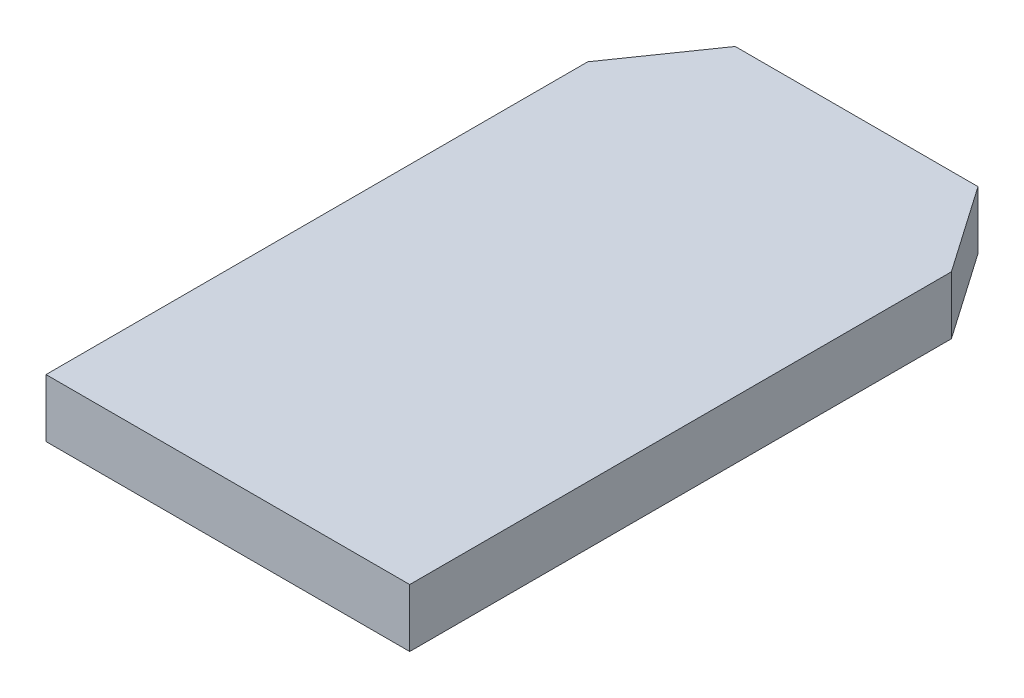
ISO-10303-21;
HEADER;
FILE_DESCRIPTION(('STEP AP214'),'2;1');
FILE_NAME('part.step','',(''),(''),'','','');
FILE_SCHEMA(('AUTOMOTIVE_DESIGN { 1 0 10303 214 1 1 1 1 }'));
ENDSEC;
DATA;
#1=APPLICATION_CONTEXT('core data for automotive mechanical design processes');
#2=APPLICATION_PROTOCOL_DEFINITION('international standard','automotive_design',2000,#1);
#3=PRODUCT_CONTEXT('',#1,'mechanical');
#4=PRODUCT('Part','Part','',(#3));
#5=PRODUCT_RELATED_PRODUCT_CATEGORY('part','',(#4));
#6=PRODUCT_DEFINITION_FORMATION('','',#4);
#7=PRODUCT_DEFINITION_CONTEXT('part definition',#1,'design');
#8=PRODUCT_DEFINITION('design','',#6,#7);
#9=PRODUCT_DEFINITION_SHAPE('','',#8);
#10=(LENGTH_UNIT() NAMED_UNIT(*) SI_UNIT(.MILLI.,.METRE.));
#11=(NAMED_UNIT(*) PLANE_ANGLE_UNIT() SI_UNIT($,.RADIAN.));
#12=(NAMED_UNIT(*) SI_UNIT($,.STERADIAN.) SOLID_ANGLE_UNIT());
#13=UNCERTAINTY_MEASURE_WITH_UNIT(LENGTH_MEASURE(1.E-05),#10,'distance_accuracy_value','');
#14=(GEOMETRIC_REPRESENTATION_CONTEXT(3) GLOBAL_UNCERTAINTY_ASSIGNED_CONTEXT((#13)) GLOBAL_UNIT_ASSIGNED_CONTEXT((#10,
#11,#12)) REPRESENTATION_CONTEXT('',''));
#15=CARTESIAN_POINT('',(0.,0.,0.));
#16=DIRECTION('',(0.,0.,1.));
#17=DIRECTION('',(1.,0.,0.));
#18=AXIS2_PLACEMENT_3D('',#15,#16,#17);
#19=CARTESIAN_POINT('',(-1.22555000000018,10.7886500000004,-12.8778000000013));
#20=DIRECTION('',(0.,1.,0.));
#21=DIRECTION('',(-1.,0.,0.));
#22=AXIS2_PLACEMENT_3D('',#19,#20,#21);
#23=PLANE('',#22);
#24=DIRECTION('',(-1.,0.,0.));
#25=VECTOR('',#24,1.);
#26=CARTESIAN_POINT('',(-3.01980662698043E-13,10.7886500000004,-12.8778000000025));
#27=LINE('',#26,#25);
#28=CARTESIAN_POINT('',(-6.00075000000018,10.7886500000004,-12.8778000000019));
#29=VERTEX_POINT('',#28);
#30=CARTESIAN_POINT('',(-1.22555000000018,10.7886500000004,-12.8778000000016));
#31=VERTEX_POINT('',#30);
#32=EDGE_CURVE('E81',#29,#31,#27,.F.);
#33=ORIENTED_EDGE('',*,*,#32,.T.);
#34=DIRECTION('',(0.,0.,-1.));
#35=VECTOR('',#34,1.);
#36=CARTESIAN_POINT('',(-1.22555000000018,10.7886500000004,-12.8778000000013));
#37=LINE('',#36,#35);
#38=CARTESIAN_POINT('',(-1.22555000000016,10.7886500000004,-19.9898000000012));
#39=VERTEX_POINT('',#38);
#40=EDGE_CURVE('E68',#39,#31,#37,.F.);
#41=ORIENTED_EDGE('',*,*,#40,.F.);
#42=DIRECTION('',(-0.570395809495346,0.,-0.821369965673295));
#43=VECTOR('',#42,1.);
#44=CARTESIAN_POINT('',(-1.62242500000019,10.7886500000004,-20.5613000000013));
#45=LINE('',#44,#43);
#46=CARTESIAN_POINT('',(-2.01930000000019,10.7886500000004,-21.1328000000013));
#47=VERTEX_POINT('',#46);
#48=EDGE_CURVE('E20',#47,#39,#45,.F.);
#49=ORIENTED_EDGE('',*,*,#48,.F.);
#50=DIRECTION('',(1.,0.,0.));
#51=VECTOR('',#50,1.);
#52=CARTESIAN_POINT('',(-3.61315000000019,10.7886500000004,-21.1328000000013));
#53=LINE('',#52,#51);
#54=CARTESIAN_POINT('',(-5.20700000000019,10.7886500000004,-21.1328000000012));
#55=VERTEX_POINT('',#54);
#56=EDGE_CURVE('E102',#47,#55,#53,.F.);
#57=ORIENTED_EDGE('',*,*,#56,.T.);
#58=DIRECTION('',(-0.570395809495345,0.,0.821369965673295));
#59=VECTOR('',#58,1.);
#60=CARTESIAN_POINT('',(-5.60387500000019,10.7886500000004,-20.5613000000012));
#61=LINE('',#60,#59);
#62=CARTESIAN_POINT('',(-6.00075000000017,10.7886500000004,-19.9898000000012));
#63=VERTEX_POINT('',#62);
#64=EDGE_CURVE('E100',#63,#55,#61,.F.);
#65=ORIENTED_EDGE('',*,*,#64,.F.);
#66=DIRECTION('',(0.,0.,1.));
#67=VECTOR('',#66,1.);
#68=CARTESIAN_POINT('',(-6.00075000000018,10.7886500000004,-12.8778000000013));
#69=LINE('',#68,#67);
#70=EDGE_CURVE('E95',#29,#63,#69,.F.);
#71=ORIENTED_EDGE('',*,*,#70,.F.);
#72=EDGE_LOOP('',(#33,#41,#49,#57,#65,#71));
#73=FACE_BOUND('',#72,.T.);
#74=ADVANCED_FACE('F17',(#73),#23,.T.);
#75=CARTESIAN_POINT('',(-1.62242500000019,10.2171500000004,-20.5613000000013));
#76=DIRECTION('',(0.821369965673295,0.,-0.570395809495346));
#77=DIRECTION('',(-0.570395809495346,0.,-0.821369965673295));
#78=AXIS2_PLACEMENT_3D('',#75,#76,#77);
#79=PLANE('',#78);
#80=DIRECTION('',(0.570395809495348,0.,0.821369965673293));
#81=VECTOR('',#80,1.);
#82=CARTESIAN_POINT('',(-2.01930000000019,10.0266500000004,-21.1328000000013));
#83=LINE('',#82,#81);
#84=CARTESIAN_POINT('',(-2.01930000000019,10.0266500000004,-21.1328000000013));
#85=VERTEX_POINT('',#84);
#86=CARTESIAN_POINT('',(-1.22555000000016,10.0266500000004,-19.9898000000013));
#87=VERTEX_POINT('',#86);
#88=EDGE_CURVE('E106',#85,#87,#83,.T.);
#89=ORIENTED_EDGE('',*,*,#88,.F.);
#90=DIRECTION('',(0.,1.,0.));
#91=VECTOR('',#90,1.);
#92=CARTESIAN_POINT('',(-2.01930000000019,10.4076500000004,-21.1328000000013));
#93=LINE('',#92,#91);
#94=EDGE_CURVE('E77',#85,#47,#93,.T.);
#95=ORIENTED_EDGE('',*,*,#94,.T.);
#96=ORIENTED_EDGE('',*,*,#48,.T.);
#97=DIRECTION('',(0.,1.,0.));
#98=VECTOR('',#97,1.);
#99=CARTESIAN_POINT('',(-1.22555000000018,10.0266500000004,-19.9898000000013));
#100=LINE('',#99,#98);
#101=EDGE_CURVE('E74',#87,#39,#100,.T.);
#102=ORIENTED_EDGE('',*,*,#101,.F.);
#103=EDGE_LOOP('',(#89,#95,#96,#102));
#104=FACE_BOUND('',#103,.T.);
#105=ADVANCED_FACE('F73',(#104),#79,.T.);
#106=CARTESIAN_POINT('',(-1.22555000000018,10.0266500000004,-12.8778000000013));
#107=DIRECTION('',(1.,0.,0.));
#108=DIRECTION('',(0.,0.,-1.));
#109=AXIS2_PLACEMENT_3D('',#106,#107,#108);
#110=PLANE('',#109);
#111=DIRECTION('',(0.,1.,0.));
#112=VECTOR('',#111,1.);
#113=CARTESIAN_POINT('',(-1.22555000000018,15.1130000000006,-12.8778000000025));
#114=LINE('',#113,#112);
#115=CARTESIAN_POINT('',(-1.22555000000018,10.0266500000004,-12.8778000000016));
#116=VERTEX_POINT('',#115);
#117=EDGE_CURVE('E83',#31,#116,#114,.F.);
#118=ORIENTED_EDGE('',*,*,#117,.T.);
#119=DIRECTION('',(0.,0.,1.));
#120=VECTOR('',#119,1.);
#121=CARTESIAN_POINT('',(-1.22555000000018,10.0266500000004,-12.8778000000013));
#122=LINE('',#121,#120);
#123=EDGE_CURVE('E87',#87,#116,#122,.T.);
#124=ORIENTED_EDGE('',*,*,#123,.F.);
#125=ORIENTED_EDGE('',*,*,#101,.T.);
#126=ORIENTED_EDGE('',*,*,#40,.T.);
#127=EDGE_LOOP('',(#118,#124,#125,#126));
#128=FACE_BOUND('',#127,.T.);
#129=ADVANCED_FACE('F85',(#128),#110,.T.);
#130=CARTESIAN_POINT('',(-3.01980662698043E-13,15.1130000000006,-12.8778000000025));
#131=DIRECTION('',(0.,0.,-1.));
#132=DIRECTION('',(-1.,0.,0.));
#133=AXIS2_PLACEMENT_3D('',#130,#131,#132);
#134=PLANE('',#133);
#135=DIRECTION('',(0.,1.,0.));
#136=VECTOR('',#135,1.);
#137=CARTESIAN_POINT('',(-6.00075000000018,10.7886500000004,-12.8778000000013));
#138=LINE('',#137,#136);
#139=CARTESIAN_POINT('',(-6.00075000000018,10.0266500000004,-12.8778000000019));
#140=VERTEX_POINT('',#139);
#141=EDGE_CURVE('E92',#140,#29,#138,.T.);
#142=ORIENTED_EDGE('',*,*,#141,.F.);
#143=DIRECTION('',(1.,0.,0.));
#144=VECTOR('',#143,1.);
#145=CARTESIAN_POINT('',(-6.00075000000018,10.0266500000004,-12.8778000000013));
#146=LINE('',#145,#144);
#147=EDGE_CURVE('E109',#116,#140,#146,.F.);
#148=ORIENTED_EDGE('',*,*,#147,.F.);
#149=ORIENTED_EDGE('',*,*,#117,.F.);
#150=ORIENTED_EDGE('',*,*,#32,.F.);
#151=EDGE_LOOP('',(#142,#148,#149,#150));
#152=FACE_BOUND('',#151,.T.);
#153=ADVANCED_FACE('F137',(#152),#134,.F.);
#154=CARTESIAN_POINT('',(-6.00075000000018,10.7886500000004,-12.8778000000013));
#155=DIRECTION('',(-1.,0.,0.));
#156=DIRECTION('',(0.,0.,1.));
#157=AXIS2_PLACEMENT_3D('',#154,#155,#156);
#158=PLANE('',#157);
#159=ORIENTED_EDGE('',*,*,#141,.T.);
#160=ORIENTED_EDGE('',*,*,#70,.T.);
#161=DIRECTION('',(0.,1.,0.));
#162=VECTOR('',#161,1.);
#163=CARTESIAN_POINT('',(-6.00075000000014,10.5981500000004,-19.9898000000013));
#164=LINE('',#163,#162);
#165=CARTESIAN_POINT('',(-6.00075000000017,10.0266500000004,-19.9898000000012));
#166=VERTEX_POINT('',#165);
#167=EDGE_CURVE('E97',#166,#63,#164,.T.);
#168=ORIENTED_EDGE('',*,*,#167,.F.);
#169=DIRECTION('',(0.,0.,1.));
#170=VECTOR('',#169,1.);
#171=CARTESIAN_POINT('',(-6.00075000000018,10.0266500000004,-12.8778000000013));
#172=LINE('',#171,#170);
#173=EDGE_CURVE('E112',#140,#166,#172,.F.);
#174=ORIENTED_EDGE('',*,*,#173,.F.);
#175=EDGE_LOOP('',(#159,#160,#168,#174));
#176=FACE_BOUND('',#175,.T.);
#177=ADVANCED_FACE('F122',(#176),#158,.T.);
#178=CARTESIAN_POINT('',(-5.60387500000019,10.5981500000004,-20.5613000000012));
#179=DIRECTION('',(-0.821369965673295,0.,-0.570395809495345));
#180=DIRECTION('',(-0.570395809495345,0.,0.821369965673295));
#181=AXIS2_PLACEMENT_3D('',#178,#179,#180);
#182=PLANE('',#181);
#183=ORIENTED_EDGE('',*,*,#64,.T.);
#184=DIRECTION('',(0.,1.,0.));
#185=VECTOR('',#184,1.);
#186=CARTESIAN_POINT('',(-5.20700000000019,10.4076500000004,-21.1328000000013));
#187=LINE('',#186,#185);
#188=CARTESIAN_POINT('',(-5.20700000000019,10.0266500000004,-21.1328000000013));
#189=VERTEX_POINT('',#188);
#190=EDGE_CURVE('E35',#55,#189,#187,.F.);
#191=ORIENTED_EDGE('',*,*,#190,.T.);
#192=DIRECTION('',(0.570395809495339,0.,-0.821369965673299));
#193=VECTOR('',#192,1.);
#194=CARTESIAN_POINT('',(-6.00075000000018,10.0266500000004,-19.9898000000013));
#195=LINE('',#194,#193);
#196=EDGE_CURVE('E26',#166,#189,#195,.T.);
#197=ORIENTED_EDGE('',*,*,#196,.F.);
#198=ORIENTED_EDGE('',*,*,#167,.T.);
#199=EDGE_LOOP('',(#183,#191,#197,#198));
#200=FACE_BOUND('',#199,.T.);
#201=ADVANCED_FACE('F119',(#200),#182,.T.);
#202=CARTESIAN_POINT('',(-3.61315000000019,10.4076500000004,-21.1328000000013));
#203=DIRECTION('',(0.,0.,1.));
#204=DIRECTION('',(1.,0.,0.));
#205=AXIS2_PLACEMENT_3D('',#202,#203,#204);
#206=PLANE('',#205);
#207=DIRECTION('',(1.,0.,0.));
#208=VECTOR('',#207,1.);
#209=CARTESIAN_POINT('',(-6.00075000000018,10.0266500000004,-21.1328000000013));
#210=LINE('',#209,#208);
#211=EDGE_CURVE('E11',#189,#85,#210,.T.);
#212=ORIENTED_EDGE('',*,*,#211,.F.);
#213=ORIENTED_EDGE('',*,*,#190,.F.);
#214=ORIENTED_EDGE('',*,*,#56,.F.);
#215=ORIENTED_EDGE('',*,*,#94,.F.);
#216=EDGE_LOOP('',(#212,#213,#214,#215));
#217=FACE_BOUND('',#216,.T.);
#218=ADVANCED_FACE('F124',(#217),#206,.F.);
#219=CARTESIAN_POINT('',(-6.00075000000018,10.0266500000004,-12.8778000000013));
#220=DIRECTION('',(0.,-1.,0.));
#221=DIRECTION('',(1.,0.,0.));
#222=AXIS2_PLACEMENT_3D('',#219,#220,#221);
#223=PLANE('',#222);
#224=ORIENTED_EDGE('',*,*,#196,.T.);
#225=ORIENTED_EDGE('',*,*,#211,.T.);
#226=ORIENTED_EDGE('',*,*,#88,.T.);
#227=ORIENTED_EDGE('',*,*,#123,.T.);
#228=ORIENTED_EDGE('',*,*,#147,.T.);
#229=ORIENTED_EDGE('',*,*,#173,.T.);
#230=EDGE_LOOP('',(#224,#225,#226,#227,#228,#229));
#231=FACE_BOUND('',#230,.T.);
#232=ADVANCED_FACE('F117',(#231),#223,.T.);
#233=CLOSED_SHELL('',(#74,#105,#129,#153,#177,#201,#218,#232));
#234=MANIFOLD_SOLID_BREP('B1',#233);
#235=ADVANCED_BREP_SHAPE_REPRESENTATION('',(#18,#234),#14);
#236=SHAPE_DEFINITION_REPRESENTATION(#9,#235);
ENDSEC;
END-ISO-10303-21;
